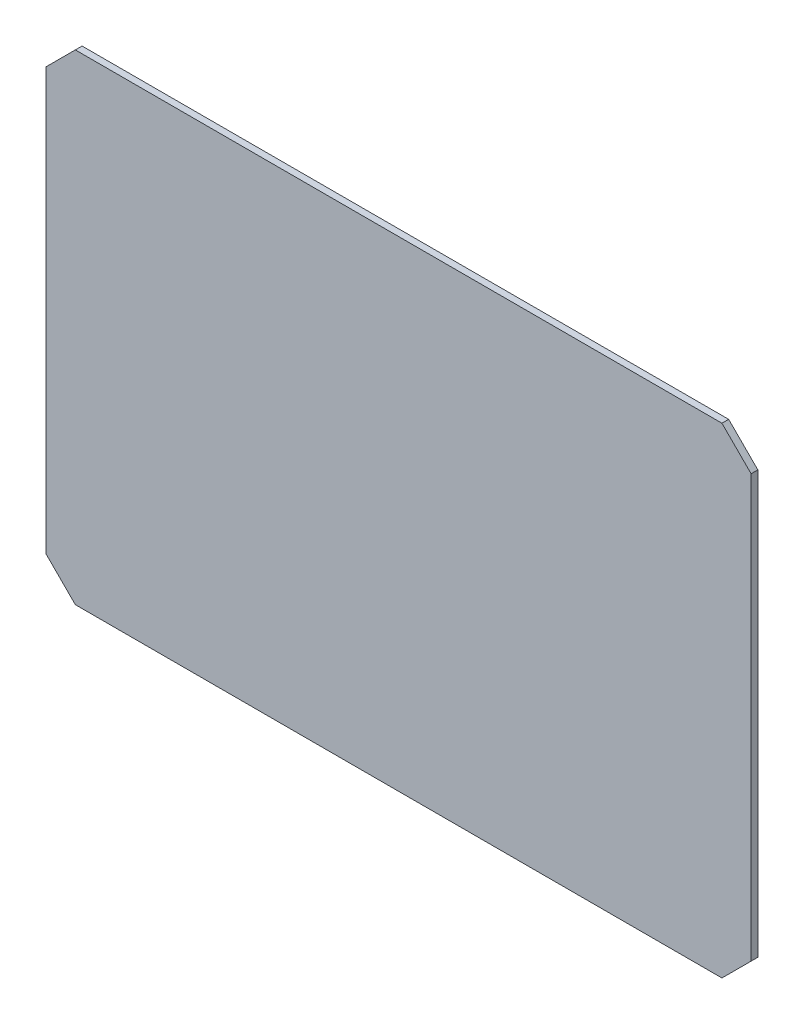
ISO-10303-21;
HEADER;
FILE_DESCRIPTION(('STEP AP214'),'2;1');
FILE_NAME('part.step','',(''),(''),'','','');
FILE_SCHEMA(('AUTOMOTIVE_DESIGN { 1 0 10303 214 1 1 1 1 }'));
ENDSEC;
DATA;
#1=APPLICATION_CONTEXT('core data for automotive mechanical design processes');
#2=APPLICATION_PROTOCOL_DEFINITION('international standard','automotive_design',2000,#1);
#3=PRODUCT_CONTEXT('',#1,'mechanical');
#4=PRODUCT('Part','Part','',(#3));
#5=PRODUCT_RELATED_PRODUCT_CATEGORY('part','',(#4));
#6=PRODUCT_DEFINITION_FORMATION('','',#4);
#7=PRODUCT_DEFINITION_CONTEXT('part definition',#1,'design');
#8=PRODUCT_DEFINITION('design','',#6,#7);
#9=PRODUCT_DEFINITION_SHAPE('','',#8);
#10=(LENGTH_UNIT() NAMED_UNIT(*) SI_UNIT(.MILLI.,.METRE.));
#11=(NAMED_UNIT(*) PLANE_ANGLE_UNIT() SI_UNIT($,.RADIAN.));
#12=(NAMED_UNIT(*) SI_UNIT($,.STERADIAN.) SOLID_ANGLE_UNIT());
#13=UNCERTAINTY_MEASURE_WITH_UNIT(LENGTH_MEASURE(1.E-05),#10,'distance_accuracy_value','');
#14=(GEOMETRIC_REPRESENTATION_CONTEXT(3) GLOBAL_UNCERTAINTY_ASSIGNED_CONTEXT((#13)) GLOBAL_UNIT_ASSIGNED_CONTEXT((#10,
#11,#12)) REPRESENTATION_CONTEXT('',''));
#15=CARTESIAN_POINT('',(0.,0.,0.));
#16=DIRECTION('',(0.,0.,1.));
#17=DIRECTION('',(1.,0.,0.));
#18=AXIS2_PLACEMENT_3D('',#15,#16,#17);
#19=CARTESIAN_POINT('',(157.,94.,3.));
#20=DIRECTION('',(-0.707106781186547,-0.707106781186548,0.));
#21=DIRECTION('',(0.707106781186548,-0.707106781186547,0.));
#22=AXIS2_PLACEMENT_3D('',#19,#20,#21);
#23=PLANE('',#22);
#24=DIRECTION('',(-0.707106781186548,0.707106781186547,0.));
#25=VECTOR('',#24,1.);
#26=CARTESIAN_POINT('',(157.,94.,0.));
#27=LINE('',#26,#25);
#28=CARTESIAN_POINT('',(157.,94.,0.));
#29=VERTEX_POINT('',#28);
#30=CARTESIAN_POINT('',(144.,107.,0.));
#31=VERTEX_POINT('',#30);
#32=EDGE_CURVE('E129',#29,#31,#27,.T.);
#33=ORIENTED_EDGE('',*,*,#32,.T.);
#34=DIRECTION('',(0.,0.,-1.));
#35=VECTOR('',#34,1.);
#36=CARTESIAN_POINT('',(144.,107.,3.));
#37=LINE('',#36,#35);
#38=CARTESIAN_POINT('',(144.,107.,3.));
#39=VERTEX_POINT('',#38);
#40=EDGE_CURVE('E11',#39,#31,#37,.T.);
#41=ORIENTED_EDGE('',*,*,#40,.F.);
#42=DIRECTION('',(-0.707106781186548,0.707106781186547,0.));
#43=VECTOR('',#42,1.);
#44=CARTESIAN_POINT('',(157.,94.,3.));
#45=LINE('',#44,#43);
#46=CARTESIAN_POINT('',(157.,94.,3.));
#47=VERTEX_POINT('',#46);
#48=EDGE_CURVE('E143',#47,#39,#45,.T.);
#49=ORIENTED_EDGE('',*,*,#48,.F.);
#50=DIRECTION('',(0.,0.,-1.));
#51=VECTOR('',#50,1.);
#52=CARTESIAN_POINT('',(157.,94.,3.));
#53=LINE('',#52,#51);
#54=EDGE_CURVE('E125',#47,#29,#53,.T.);
#55=ORIENTED_EDGE('',*,*,#54,.T.);
#56=EDGE_LOOP('',(#33,#41,#49,#55));
#57=FACE_BOUND('',#56,.T.);
#58=ADVANCED_FACE('F33',(#57),#23,.F.);
#59=CARTESIAN_POINT('',(144.,107.,3.));
#60=DIRECTION('',(0.,-1.,0.));
#61=DIRECTION('',(0.,0.,-1.));
#62=AXIS2_PLACEMENT_3D('',#59,#60,#61);
#63=PLANE('',#62);
#64=DIRECTION('',(-1.,0.,0.));
#65=VECTOR('',#64,1.);
#66=CARTESIAN_POINT('',(144.,107.,0.));
#67=LINE('',#66,#65);
#68=CARTESIAN_POINT('',(-144.,107.,0.));
#69=VERTEX_POINT('',#68);
#70=EDGE_CURVE('E132',#31,#69,#67,.T.);
#71=ORIENTED_EDGE('',*,*,#70,.T.);
#72=DIRECTION('',(0.,0.,-1.));
#73=VECTOR('',#72,1.);
#74=CARTESIAN_POINT('',(-144.,107.,3.));
#75=LINE('',#74,#73);
#76=CARTESIAN_POINT('',(-144.,107.,3.));
#77=VERTEX_POINT('',#76);
#78=EDGE_CURVE('E41',#77,#69,#75,.T.);
#79=ORIENTED_EDGE('',*,*,#78,.F.);
#80=DIRECTION('',(-1.,0.,0.));
#81=VECTOR('',#80,1.);
#82=CARTESIAN_POINT('',(144.,107.,3.));
#83=LINE('',#82,#81);
#84=EDGE_CURVE('E92',#39,#77,#83,.T.);
#85=ORIENTED_EDGE('',*,*,#84,.F.);
#86=ORIENTED_EDGE('',*,*,#40,.T.);
#87=EDGE_LOOP('',(#71,#79,#85,#86));
#88=FACE_BOUND('',#87,.T.);
#89=ADVANCED_FACE('F178',(#88),#63,.F.);
#90=CARTESIAN_POINT('',(-157.,94.,3.));
#91=DIRECTION('',(0.707106781186547,-0.707106781186548,0.));
#92=DIRECTION('',(0.707106781186548,0.707106781186547,0.));
#93=AXIS2_PLACEMENT_3D('',#90,#91,#92);
#94=PLANE('',#93);
#95=DIRECTION('',(-0.707106781186548,-0.707106781186547,0.));
#96=VECTOR('',#95,1.);
#97=CARTESIAN_POINT('',(-157.,94.,0.));
#98=LINE('',#97,#96);
#99=CARTESIAN_POINT('',(-157.,94.,0.));
#100=VERTEX_POINT('',#99);
#101=EDGE_CURVE('E134',#69,#100,#98,.T.);
#102=ORIENTED_EDGE('',*,*,#101,.T.);
#103=DIRECTION('',(0.,0.,-1.));
#104=VECTOR('',#103,1.);
#105=CARTESIAN_POINT('',(-157.,94.,3.));
#106=LINE('',#105,#104);
#107=CARTESIAN_POINT('',(-157.,94.,3.));
#108=VERTEX_POINT('',#107);
#109=EDGE_CURVE('E150',#108,#100,#106,.T.);
#110=ORIENTED_EDGE('',*,*,#109,.F.);
#111=DIRECTION('',(-0.707106781186548,-0.707106781186547,0.));
#112=VECTOR('',#111,1.);
#113=CARTESIAN_POINT('',(-157.,94.,3.));
#114=LINE('',#113,#112);
#115=EDGE_CURVE('E158',#77,#108,#114,.T.);
#116=ORIENTED_EDGE('',*,*,#115,.F.);
#117=ORIENTED_EDGE('',*,*,#78,.T.);
#118=EDGE_LOOP('',(#102,#110,#116,#117));
#119=FACE_BOUND('',#118,.T.);
#120=ADVANCED_FACE('F156',(#119),#94,.F.);
#121=CARTESIAN_POINT('',(-157.,-94.,3.));
#122=DIRECTION('',(1.,0.,0.));
#123=DIRECTION('',(0.,0.,-1.));
#124=AXIS2_PLACEMENT_3D('',#121,#122,#123);
#125=PLANE('',#124);
#126=DIRECTION('',(0.,-1.,0.));
#127=VECTOR('',#126,1.);
#128=CARTESIAN_POINT('',(-157.,-94.,0.));
#129=LINE('',#128,#127);
#130=CARTESIAN_POINT('',(-157.,-94.,0.));
#131=VERTEX_POINT('',#130);
#132=EDGE_CURVE('E136',#100,#131,#129,.T.);
#133=ORIENTED_EDGE('',*,*,#132,.T.);
#134=DIRECTION('',(0.,0.,-1.));
#135=VECTOR('',#134,1.);
#136=CARTESIAN_POINT('',(-157.,-94.,3.));
#137=LINE('',#136,#135);
#138=CARTESIAN_POINT('',(-157.,-94.,3.));
#139=VERTEX_POINT('',#138);
#140=EDGE_CURVE('E147',#139,#131,#137,.T.);
#141=ORIENTED_EDGE('',*,*,#140,.F.);
#142=DIRECTION('',(0.,-1.,0.));
#143=VECTOR('',#142,1.);
#144=CARTESIAN_POINT('',(-157.,-94.,3.));
#145=LINE('',#144,#143);
#146=EDGE_CURVE('E170',#108,#139,#145,.T.);
#147=ORIENTED_EDGE('',*,*,#146,.F.);
#148=ORIENTED_EDGE('',*,*,#109,.T.);
#149=EDGE_LOOP('',(#133,#141,#147,#148));
#150=FACE_BOUND('',#149,.T.);
#151=ADVANCED_FACE('F166',(#150),#125,.F.);
#152=CARTESIAN_POINT('',(-157.,-94.,3.));
#153=DIRECTION('',(0.707106781186547,0.707106781186548,0.));
#154=DIRECTION('',(-0.707106781186548,0.707106781186547,0.));
#155=AXIS2_PLACEMENT_3D('',#152,#153,#154);
#156=PLANE('',#155);
#157=DIRECTION('',(0.707106781186548,-0.707106781186547,0.));
#158=VECTOR('',#157,1.);
#159=CARTESIAN_POINT('',(-157.,-94.,0.));
#160=LINE('',#159,#158);
#161=CARTESIAN_POINT('',(-144.,-107.,0.));
#162=VERTEX_POINT('',#161);
#163=EDGE_CURVE('E138',#131,#162,#160,.T.);
#164=ORIENTED_EDGE('',*,*,#163,.T.);
#165=DIRECTION('',(0.,0.,-1.));
#166=VECTOR('',#165,1.);
#167=CARTESIAN_POINT('',(-144.,-107.,3.));
#168=LINE('',#167,#166);
#169=CARTESIAN_POINT('',(-144.,-107.,3.));
#170=VERTEX_POINT('',#169);
#171=EDGE_CURVE('E120',#170,#162,#168,.T.);
#172=ORIENTED_EDGE('',*,*,#171,.F.);
#173=DIRECTION('',(0.707106781186548,-0.707106781186547,0.));
#174=VECTOR('',#173,1.);
#175=CARTESIAN_POINT('',(-157.,-94.,3.));
#176=LINE('',#175,#174);
#177=EDGE_CURVE('E111',#139,#170,#176,.T.);
#178=ORIENTED_EDGE('',*,*,#177,.F.);
#179=ORIENTED_EDGE('',*,*,#140,.T.);
#180=EDGE_LOOP('',(#164,#172,#178,#179));
#181=FACE_BOUND('',#180,.T.);
#182=ADVANCED_FACE('F169',(#181),#156,.F.);
#183=CARTESIAN_POINT('',(144.,-107.,3.));
#184=DIRECTION('',(0.,1.,0.));
#185=DIRECTION('',(0.,0.,1.));
#186=AXIS2_PLACEMENT_3D('',#183,#184,#185);
#187=PLANE('',#186);
#188=DIRECTION('',(1.,0.,0.));
#189=VECTOR('',#188,1.);
#190=CARTESIAN_POINT('',(144.,-107.,0.));
#191=LINE('',#190,#189);
#192=CARTESIAN_POINT('',(144.,-107.,0.));
#193=VERTEX_POINT('',#192);
#194=EDGE_CURVE('E119',#162,#193,#191,.T.);
#195=ORIENTED_EDGE('',*,*,#194,.T.);
#196=DIRECTION('',(0.,0.,-1.));
#197=VECTOR('',#196,1.);
#198=CARTESIAN_POINT('',(144.,-107.,3.));
#199=LINE('',#198,#197);
#200=CARTESIAN_POINT('',(144.,-107.,3.));
#201=VERTEX_POINT('',#200);
#202=EDGE_CURVE('E116',#201,#193,#199,.T.);
#203=ORIENTED_EDGE('',*,*,#202,.F.);
#204=DIRECTION('',(1.,0.,0.));
#205=VECTOR('',#204,1.);
#206=CARTESIAN_POINT('',(144.,-107.,3.));
#207=LINE('',#206,#205);
#208=EDGE_CURVE('E105',#170,#201,#207,.T.);
#209=ORIENTED_EDGE('',*,*,#208,.F.);
#210=ORIENTED_EDGE('',*,*,#171,.T.);
#211=EDGE_LOOP('',(#195,#203,#209,#210));
#212=FACE_BOUND('',#211,.T.);
#213=ADVANCED_FACE('F117',(#212),#187,.F.);
#214=CARTESIAN_POINT('',(157.,-94.,3.));
#215=DIRECTION('',(-0.707106781186547,0.707106781186548,0.));
#216=DIRECTION('',(-0.707106781186548,-0.707106781186547,0.));
#217=AXIS2_PLACEMENT_3D('',#214,#215,#216);
#218=PLANE('',#217);
#219=DIRECTION('',(0.707106781186548,0.707106781186547,0.));
#220=VECTOR('',#219,1.);
#221=CARTESIAN_POINT('',(157.,-94.,0.));
#222=LINE('',#221,#220);
#223=CARTESIAN_POINT('',(157.,-94.,0.));
#224=VERTEX_POINT('',#223);
#225=EDGE_CURVE('E78',#193,#224,#222,.T.);
#226=ORIENTED_EDGE('',*,*,#225,.T.);
#227=DIRECTION('',(0.,0.,-1.));
#228=VECTOR('',#227,1.);
#229=CARTESIAN_POINT('',(157.,-94.,3.));
#230=LINE('',#229,#228);
#231=CARTESIAN_POINT('',(157.,-94.,3.));
#232=VERTEX_POINT('',#231);
#233=EDGE_CURVE('E121',#232,#224,#230,.T.);
#234=ORIENTED_EDGE('',*,*,#233,.F.);
#235=DIRECTION('',(0.707106781186548,0.707106781186547,0.));
#236=VECTOR('',#235,1.);
#237=CARTESIAN_POINT('',(157.,-94.,3.));
#238=LINE('',#237,#236);
#239=EDGE_CURVE('E109',#201,#232,#238,.T.);
#240=ORIENTED_EDGE('',*,*,#239,.F.);
#241=ORIENTED_EDGE('',*,*,#202,.T.);
#242=EDGE_LOOP('',(#226,#234,#240,#241));
#243=FACE_BOUND('',#242,.T.);
#244=ADVANCED_FACE('F123',(#243),#218,.F.);
#245=CARTESIAN_POINT('',(157.,-94.,3.));
#246=DIRECTION('',(-1.,0.,0.));
#247=DIRECTION('',(0.,0.,1.));
#248=AXIS2_PLACEMENT_3D('',#245,#246,#247);
#249=PLANE('',#248);
#250=DIRECTION('',(0.,1.,0.));
#251=VECTOR('',#250,1.);
#252=CARTESIAN_POINT('',(157.,-94.,0.));
#253=LINE('',#252,#251);
#254=EDGE_CURVE('E84',#224,#29,#253,.T.);
#255=ORIENTED_EDGE('',*,*,#254,.T.);
#256=ORIENTED_EDGE('',*,*,#54,.F.);
#257=DIRECTION('',(0.,1.,0.));
#258=VECTOR('',#257,1.);
#259=CARTESIAN_POINT('',(157.,-94.,3.));
#260=LINE('',#259,#258);
#261=EDGE_CURVE('E49',#232,#47,#260,.T.);
#262=ORIENTED_EDGE('',*,*,#261,.F.);
#263=ORIENTED_EDGE('',*,*,#233,.T.);
#264=EDGE_LOOP('',(#255,#256,#262,#263));
#265=FACE_BOUND('',#264,.T.);
#266=ADVANCED_FACE('F194',(#265),#249,.F.);
#267=CARTESIAN_POINT('',(0.,0.,3.));
#268=DIRECTION('',(0.,0.,-1.));
#269=DIRECTION('',(-1.,0.,0.));
#270=AXIS2_PLACEMENT_3D('',#267,#268,#269);
#271=PLANE('',#270);
#272=ORIENTED_EDGE('',*,*,#48,.T.);
#273=ORIENTED_EDGE('',*,*,#84,.T.);
#274=ORIENTED_EDGE('',*,*,#115,.T.);
#275=ORIENTED_EDGE('',*,*,#146,.T.);
#276=ORIENTED_EDGE('',*,*,#177,.T.);
#277=ORIENTED_EDGE('',*,*,#208,.T.);
#278=ORIENTED_EDGE('',*,*,#239,.T.);
#279=ORIENTED_EDGE('',*,*,#261,.T.);
#280=EDGE_LOOP('',(#272,#273,#274,#275,#276,#277,#278,#279));
#281=FACE_BOUND('',#280,.T.);
#282=ADVANCED_FACE('F107',(#281),#271,.F.);
#283=CARTESIAN_POINT('',(0.,0.,0.));
#284=DIRECTION('',(0.,0.,-1.));
#285=DIRECTION('',(-1.,0.,0.));
#286=AXIS2_PLACEMENT_3D('',#283,#284,#285);
#287=PLANE('',#286);
#288=ORIENTED_EDGE('',*,*,#32,.F.);
#289=ORIENTED_EDGE('',*,*,#254,.F.);
#290=ORIENTED_EDGE('',*,*,#225,.F.);
#291=ORIENTED_EDGE('',*,*,#194,.F.);
#292=ORIENTED_EDGE('',*,*,#163,.F.);
#293=ORIENTED_EDGE('',*,*,#132,.F.);
#294=ORIENTED_EDGE('',*,*,#101,.F.);
#295=ORIENTED_EDGE('',*,*,#70,.F.);
#296=EDGE_LOOP('',(#288,#289,#290,#291,#292,#293,#294,#295));
#297=FACE_BOUND('',#296,.T.);
#298=ADVANCED_FACE('F162',(#297),#287,.T.);
#299=CLOSED_SHELL('',(#58,#89,#120,#151,#182,#213,#244,#266,#282,#298));
#300=MANIFOLD_SOLID_BREP('B2',#299);
#301=ADVANCED_BREP_SHAPE_REPRESENTATION('',(#18,#300),#14);
#302=SHAPE_DEFINITION_REPRESENTATION(#9,#301);
ENDSEC;
END-ISO-10303-21;
